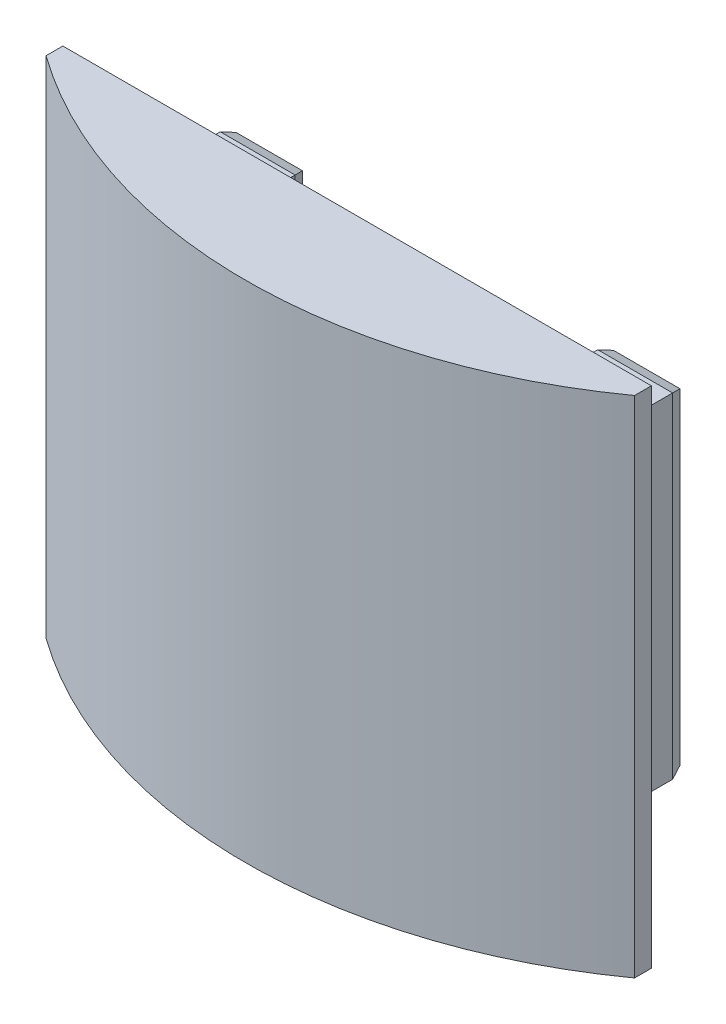
ISO-10303-21;
HEADER;
FILE_DESCRIPTION(('STEP AP214'),'2;1');
FILE_NAME('part.step','',(''),(''),'','','');
FILE_SCHEMA(('AUTOMOTIVE_DESIGN { 1 0 10303 214 1 1 1 1 }'));
ENDSEC;
DATA;
#1=APPLICATION_CONTEXT('core data for automotive mechanical design processes');
#2=APPLICATION_PROTOCOL_DEFINITION('international standard','automotive_design',2000,#1);
#3=PRODUCT_CONTEXT('',#1,'mechanical');
#4=PRODUCT('Part','Part','',(#3));
#5=PRODUCT_RELATED_PRODUCT_CATEGORY('part','',(#4));
#6=PRODUCT_DEFINITION_FORMATION('','',#4);
#7=PRODUCT_DEFINITION_CONTEXT('part definition',#1,'design');
#8=PRODUCT_DEFINITION('design','',#6,#7);
#9=PRODUCT_DEFINITION_SHAPE('','',#8);
#10=(LENGTH_UNIT() NAMED_UNIT(*) SI_UNIT(.MILLI.,.METRE.));
#11=(NAMED_UNIT(*) PLANE_ANGLE_UNIT() SI_UNIT($,.RADIAN.));
#12=(NAMED_UNIT(*) SI_UNIT($,.STERADIAN.) SOLID_ANGLE_UNIT());
#13=UNCERTAINTY_MEASURE_WITH_UNIT(LENGTH_MEASURE(1.E-05),#10,'distance_accuracy_value','');
#14=(GEOMETRIC_REPRESENTATION_CONTEXT(3) GLOBAL_UNCERTAINTY_ASSIGNED_CONTEXT((#13)) GLOBAL_UNIT_ASSIGNED_CONTEXT((#10,
#11,#12)) REPRESENTATION_CONTEXT('',''));
#15=CARTESIAN_POINT('',(0.,0.,0.));
#16=DIRECTION('',(0.,0.,1.));
#17=DIRECTION('',(1.,0.,0.));
#18=AXIS2_PLACEMENT_3D('',#15,#16,#17);
#19=CARTESIAN_POINT('',(35.,-30.,43.5));
#20=DIRECTION('',(0.,1.,0.));
#21=DIRECTION('',(0.,0.,1.));
#22=AXIS2_PLACEMENT_3D('',#19,#20,#21);
#23=PLANE('',#22);
#24=DIRECTION('',(0.,0.,-1.));
#25=VECTOR('',#24,1.);
#26=CARTESIAN_POINT('',(35.,-30.,43.5));
#27=LINE('',#26,#25);
#28=CARTESIAN_POINT('',(35.,-30.,14.));
#29=VERTEX_POINT('',#28);
#30=CARTESIAN_POINT('',(35.,-30.,12.));
#31=VERTEX_POINT('',#30);
#32=EDGE_CURVE('E171',#29,#31,#27,.T.);
#33=ORIENTED_EDGE('',*,*,#32,.F.);
#34=CARTESIAN_POINT('',(0.,-30.,-34.7339717240448));
#35=DIRECTION('',(0.,1.,0.));
#36=DIRECTION('',(0.,0.,1.));
#37=AXIS2_PLACEMENT_3D('',#34,#35,#36);
#38=CIRCLE('',#37,60.);
#39=CARTESIAN_POINT('',(-35.,-30.,14.));
#40=VERTEX_POINT('',#39);
#41=EDGE_CURVE('E155',#40,#29,#38,.T.);
#42=ORIENTED_EDGE('',*,*,#41,.F.);
#43=DIRECTION('',(0.,0.,-1.));
#44=VECTOR('',#43,1.);
#45=CARTESIAN_POINT('',(-35.,-30.,43.5));
#46=LINE('',#45,#44);
#47=CARTESIAN_POINT('',(-35.,-30.,12.));
#48=VERTEX_POINT('',#47);
#49=EDGE_CURVE('E163',#40,#48,#46,.T.);
#50=ORIENTED_EDGE('',*,*,#49,.T.);
#51=DIRECTION('',(1.,0.,0.));
#52=VECTOR('',#51,1.);
#53=CARTESIAN_POINT('',(35.,-30.,12.));
#54=LINE('',#53,#52);
#55=EDGE_CURVE('E316',#48,#31,#54,.T.);
#56=ORIENTED_EDGE('',*,*,#55,.T.);
#57=EDGE_LOOP('',(#33,#42,#50,#56));
#58=FACE_BOUND('',#57,.T.);
#59=ADVANCED_FACE('F35',(#58),#23,.F.);
#60=CARTESIAN_POINT('',(35.,30.,43.5));
#61=DIRECTION('',(0.,-1.,0.));
#62=DIRECTION('',(0.,0.,-1.));
#63=AXIS2_PLACEMENT_3D('',#60,#61,#62);
#64=PLANE('',#63);
#65=DIRECTION('',(0.,0.,-1.));
#66=VECTOR('',#65,1.);
#67=CARTESIAN_POINT('',(-35.,30.,43.5));
#68=LINE('',#67,#66);
#69=CARTESIAN_POINT('',(-35.,30.,14.));
#70=VERTEX_POINT('',#69);
#71=CARTESIAN_POINT('',(-35.,30.,12.));
#72=VERTEX_POINT('',#71);
#73=EDGE_CURVE('E161',#70,#72,#68,.T.);
#74=ORIENTED_EDGE('',*,*,#73,.F.);
#75=CARTESIAN_POINT('',(0.,30.,-34.7339717240448));
#76=DIRECTION('',(0.,1.,0.));
#77=DIRECTION('',(0.,0.,1.));
#78=AXIS2_PLACEMENT_3D('',#75,#76,#77);
#79=CIRCLE('',#78,60.);
#80=CARTESIAN_POINT('',(35.,30.,14.));
#81=VERTEX_POINT('',#80);
#82=EDGE_CURVE('E147',#70,#81,#79,.T.);
#83=ORIENTED_EDGE('',*,*,#82,.T.);
#84=DIRECTION('',(0.,0.,-1.));
#85=VECTOR('',#84,1.);
#86=CARTESIAN_POINT('',(35.,30.,43.5));
#87=LINE('',#86,#85);
#88=CARTESIAN_POINT('',(35.,30.,12.));
#89=VERTEX_POINT('',#88);
#90=EDGE_CURVE('E169',#81,#89,#87,.T.);
#91=ORIENTED_EDGE('',*,*,#90,.T.);
#92=DIRECTION('',(-1.,0.,0.));
#93=VECTOR('',#92,1.);
#94=CARTESIAN_POINT('',(35.,30.,12.));
#95=LINE('',#94,#93);
#96=EDGE_CURVE('E167',#89,#72,#95,.T.);
#97=ORIENTED_EDGE('',*,*,#96,.T.);
#98=EDGE_LOOP('',(#74,#83,#91,#97));
#99=FACE_BOUND('',#98,.T.);
#100=ADVANCED_FACE('F165',(#99),#64,.F.);
#101=CARTESIAN_POINT('',(26.9,-19.9,12.));
#102=DIRECTION('',(0.,1.,0.));
#103=DIRECTION('',(-1.,0.,0.));
#104=AXIS2_PLACEMENT_3D('',#101,#102,#103);
#105=PLANE('',#104);
#106=CARTESIAN_POINT('',(-22.5,-19.9,4.60000000000001));
#107=DIRECTION('',(0.,1.,0.));
#108=DIRECTION('',(-1.,0.,0.));
#109=AXIS2_PLACEMENT_3D('',#106,#107,#108);
#110=CIRCLE('',#109,2.1);
#111=CARTESIAN_POINT('',(-24.6,-19.9,4.60000000000001));
#112=VERTEX_POINT('',#111);
#113=EDGE_CURVE('E305',#112,#112,#110,.T.);
#114=ORIENTED_EDGE('',*,*,#113,.T.);
#115=EDGE_LOOP('',(#114));
#116=FACE_BOUND('',#115,.T.);
#117=DIRECTION('',(0.,0.,-1.));
#118=VECTOR('',#117,1.);
#119=CARTESIAN_POINT('',(-26.9,-19.9,12.));
#120=LINE('',#119,#118);
#121=CARTESIAN_POINT('',(-26.9,-19.9,12.));
#122=VERTEX_POINT('',#121);
#123=CARTESIAN_POINT('',(-26.9,-19.9,1.3737387097273));
#124=VERTEX_POINT('',#123);
#125=EDGE_CURVE('E202',#122,#124,#120,.T.);
#126=ORIENTED_EDGE('',*,*,#125,.T.);
#127=DIRECTION('',(1.,0.,0.));
#128=VECTOR('',#127,1.);
#129=CARTESIAN_POINT('',(26.9,-19.9,1.3737387097273));
#130=LINE('',#129,#128);
#131=CARTESIAN_POINT('',(-18.,-19.9,1.3737387097273));
#132=VERTEX_POINT('',#131);
#133=EDGE_CURVE('E235',#124,#132,#130,.T.);
#134=ORIENTED_EDGE('',*,*,#133,.T.);
#135=DIRECTION('',(0.,0.,-1.));
#136=VECTOR('',#135,1.);
#137=CARTESIAN_POINT('',(-18.,-19.9,65.6660041366972));
#138=LINE('',#137,#136);
#139=CARTESIAN_POINT('',(-18.,-19.9,12.));
#140=VERTEX_POINT('',#139);
#141=EDGE_CURVE('E248',#140,#132,#138,.T.);
#142=ORIENTED_EDGE('',*,*,#141,.F.);
#143=DIRECTION('',(1.,0.,0.));
#144=VECTOR('',#143,1.);
#145=CARTESIAN_POINT('',(26.9,-19.9,12.));
#146=LINE('',#145,#144);
#147=EDGE_CURVE('E183',#122,#140,#146,.T.);
#148=ORIENTED_EDGE('',*,*,#147,.F.);
#149=EDGE_LOOP('',(#126,#134,#142,#148));
#150=FACE_BOUND('',#149,.T.);
#151=ADVANCED_FACE('F282',(#116,#150),#105,.F.);
#152=CARTESIAN_POINT('',(26.9,19.9,12.));
#153=DIRECTION('',(0.,-1.,0.));
#154=DIRECTION('',(1.,0.,0.));
#155=AXIS2_PLACEMENT_3D('',#152,#153,#154);
#156=PLANE('',#155);
#157=CARTESIAN_POINT('',(-22.5,19.9,4.60000000000001));
#158=DIRECTION('',(0.,1.,0.));
#159=DIRECTION('',(-1.,0.,0.));
#160=AXIS2_PLACEMENT_3D('',#157,#158,#159);
#161=CIRCLE('',#160,2.1);
#162=CARTESIAN_POINT('',(-24.6,19.9,4.60000000000001));
#163=VERTEX_POINT('',#162);
#164=EDGE_CURVE('E302',#163,#163,#161,.T.);
#165=ORIENTED_EDGE('',*,*,#164,.F.);
#166=EDGE_LOOP('',(#165));
#167=FACE_BOUND('',#166,.T.);
#168=DIRECTION('',(0.,0.,-1.));
#169=VECTOR('',#168,1.);
#170=CARTESIAN_POINT('',(-18.,19.9,65.6660041366972));
#171=LINE('',#170,#169);
#172=CARTESIAN_POINT('',(-18.,19.9,12.));
#173=VERTEX_POINT('',#172);
#174=CARTESIAN_POINT('',(-18.,19.9,1.3737387097273));
#175=VERTEX_POINT('',#174);
#176=EDGE_CURVE('E290',#173,#175,#171,.T.);
#177=ORIENTED_EDGE('',*,*,#176,.T.);
#178=DIRECTION('',(-1.,0.,0.));
#179=VECTOR('',#178,1.);
#180=CARTESIAN_POINT('',(26.9,19.9,1.3737387097273));
#181=LINE('',#180,#179);
#182=CARTESIAN_POINT('',(-26.9,19.9,1.3737387097273));
#183=VERTEX_POINT('',#182);
#184=EDGE_CURVE('E11',#175,#183,#181,.T.);
#185=ORIENTED_EDGE('',*,*,#184,.T.);
#186=DIRECTION('',(0.,0.,-1.));
#187=VECTOR('',#186,1.);
#188=CARTESIAN_POINT('',(-26.9,19.9,12.));
#189=LINE('',#188,#187);
#190=CARTESIAN_POINT('',(-26.9,19.9,12.));
#191=VERTEX_POINT('',#190);
#192=EDGE_CURVE('E193',#191,#183,#189,.T.);
#193=ORIENTED_EDGE('',*,*,#192,.F.);
#194=DIRECTION('',(-1.,0.,0.));
#195=VECTOR('',#194,1.);
#196=CARTESIAN_POINT('',(26.9,19.9,12.));
#197=LINE('',#196,#195);
#198=EDGE_CURVE('E189',#173,#191,#197,.T.);
#199=ORIENTED_EDGE('',*,*,#198,.F.);
#200=EDGE_LOOP('',(#177,#185,#193,#199));
#201=FACE_BOUND('',#200,.T.);
#202=ADVANCED_FACE('F289',(#167,#201),#156,.F.);
#203=CARTESIAN_POINT('',(0.,0.,0.));
#204=DIRECTION('',(0.,0.,1.));
#205=DIRECTION('',(1.,0.,0.));
#206=AXIS2_PLACEMENT_3D('',#203,#204,#205);
#207=PLANE('',#206);
#208=DIRECTION('',(-1.,0.,0.));
#209=VECTOR('',#208,1.);
#210=CARTESIAN_POINT('',(0.,-19.4,0.));
#211=LINE('',#210,#209);
#212=CARTESIAN_POINT('',(-18.5,-19.4,0.));
#213=VERTEX_POINT('',#212);
#214=CARTESIAN_POINT('',(-26.4,-19.4,0.));
#215=VERTEX_POINT('',#214);
#216=EDGE_CURVE('E230',#213,#215,#211,.T.);
#217=ORIENTED_EDGE('',*,*,#216,.T.);
#218=DIRECTION('',(0.,1.,0.));
#219=VECTOR('',#218,1.);
#220=CARTESIAN_POINT('',(-26.4,0.,0.));
#221=LINE('',#220,#219);
#222=CARTESIAN_POINT('',(-26.4,19.4,0.));
#223=VERTEX_POINT('',#222);
#224=EDGE_CURVE('E232',#215,#223,#221,.T.);
#225=ORIENTED_EDGE('',*,*,#224,.T.);
#226=DIRECTION('',(1.,0.,0.));
#227=VECTOR('',#226,1.);
#228=CARTESIAN_POINT('',(0.,19.4,0.));
#229=LINE('',#228,#227);
#230=CARTESIAN_POINT('',(-18.5,19.4,0.));
#231=VERTEX_POINT('',#230);
#232=EDGE_CURVE('E226',#223,#231,#229,.T.);
#233=ORIENTED_EDGE('',*,*,#232,.T.);
#234=DIRECTION('',(0.,-1.,0.));
#235=VECTOR('',#234,1.);
#236=CARTESIAN_POINT('',(-18.5,0.,0.));
#237=LINE('',#236,#235);
#238=EDGE_CURVE('E228',#231,#213,#237,.T.);
#239=ORIENTED_EDGE('',*,*,#238,.T.);
#240=EDGE_LOOP('',(#217,#225,#233,#239));
#241=FACE_BOUND('',#240,.T.);
#242=ADVANCED_FACE('F268',(#241),#207,.F.);
#243=CARTESIAN_POINT('',(-26.9,-19.9,12.));
#244=DIRECTION('',(1.,0.,0.));
#245=DIRECTION('',(0.,0.,-1.));
#246=AXIS2_PLACEMENT_3D('',#243,#244,#245);
#247=PLANE('',#246);
#248=ORIENTED_EDGE('',*,*,#192,.T.);
#249=DIRECTION('',(0.,-1.,0.));
#250=VECTOR('',#249,1.);
#251=CARTESIAN_POINT('',(-26.9,-19.9,1.3737387097273));
#252=LINE('',#251,#250);
#253=EDGE_CURVE('E223',#183,#124,#252,.T.);
#254=ORIENTED_EDGE('',*,*,#253,.T.);
#255=ORIENTED_EDGE('',*,*,#125,.F.);
#256=DIRECTION('',(0.,-1.,0.));
#257=VECTOR('',#256,1.);
#258=CARTESIAN_POINT('',(-26.9,-19.9,12.));
#259=LINE('',#258,#257);
#260=EDGE_CURVE('E179',#191,#122,#259,.T.);
#261=ORIENTED_EDGE('',*,*,#260,.F.);
#262=EDGE_LOOP('',(#248,#254,#255,#261));
#263=FACE_BOUND('',#262,.T.);
#264=ADVANCED_FACE('F279',(#263),#247,.F.);
#265=CARTESIAN_POINT('',(22.5,-19.9,4.6));
#266=DIRECTION('',(0.,1.,0.));
#267=DIRECTION('',(-1.,0.,0.));
#268=AXIS2_PLACEMENT_3D('',#265,#266,#267);
#269=CIRCLE('',#268,2.1);
#270=CARTESIAN_POINT('',(20.4,-19.9,4.6));
#271=VERTEX_POINT('',#270);
#272=EDGE_CURVE('E311',#271,#271,#269,.T.);
#273=ORIENTED_EDGE('',*,*,#272,.T.);
#274=EDGE_LOOP('',(#273));
#275=FACE_BOUND('',#274,.T.);
#276=DIRECTION('',(0.,0.,-1.));
#277=VECTOR('',#276,1.);
#278=CARTESIAN_POINT('',(18.,-19.9,65.6660041366972));
#279=LINE('',#278,#277);
#280=CARTESIAN_POINT('',(18.,-19.9,12.));
#281=VERTEX_POINT('',#280);
#282=CARTESIAN_POINT('',(18.,-19.9,1.3737387097273));
#283=VERTEX_POINT('',#282);
#284=EDGE_CURVE('E299',#281,#283,#279,.T.);
#285=ORIENTED_EDGE('',*,*,#284,.T.);
#286=DIRECTION('',(1.,0.,0.));
#287=VECTOR('',#286,1.);
#288=CARTESIAN_POINT('',(26.9,-19.9,1.3737387097273));
#289=LINE('',#288,#287);
#290=CARTESIAN_POINT('',(26.9,-19.9,1.3737387097273));
#291=VERTEX_POINT('',#290);
#292=EDGE_CURVE('E221',#283,#291,#289,.T.);
#293=ORIENTED_EDGE('',*,*,#292,.T.);
#294=DIRECTION('',(0.,0.,-1.));
#295=VECTOR('',#294,1.);
#296=CARTESIAN_POINT('',(26.9,-19.9,12.));
#297=LINE('',#296,#295);
#298=CARTESIAN_POINT('',(26.9,-19.9,12.));
#299=VERTEX_POINT('',#298);
#300=EDGE_CURVE('E199',#299,#291,#297,.T.);
#301=ORIENTED_EDGE('',*,*,#300,.F.);
#302=EDGE_CURVE('E182',#281,#299,#146,.T.);
#303=ORIENTED_EDGE('',*,*,#302,.F.);
#304=EDGE_LOOP('',(#285,#293,#301,#303));
#305=FACE_BOUND('',#304,.T.);
#306=ADVANCED_FACE('F339',(#275,#305),#105,.F.);
#307=CARTESIAN_POINT('',(26.9,-19.9,12.));
#308=DIRECTION('',(-1.,0.,0.));
#309=DIRECTION('',(0.,0.,1.));
#310=AXIS2_PLACEMENT_3D('',#307,#308,#309);
#311=PLANE('',#310);
#312=ORIENTED_EDGE('',*,*,#300,.T.);
#313=DIRECTION('',(0.,1.,0.));
#314=VECTOR('',#313,1.);
#315=CARTESIAN_POINT('',(26.9,-19.9,1.3737387097273));
#316=LINE('',#315,#314);
#317=CARTESIAN_POINT('',(26.9,19.9,1.3737387097273));
#318=VERTEX_POINT('',#317);
#319=EDGE_CURVE('E205',#291,#318,#316,.T.);
#320=ORIENTED_EDGE('',*,*,#319,.T.);
#321=DIRECTION('',(0.,0.,-1.));
#322=VECTOR('',#321,1.);
#323=CARTESIAN_POINT('',(26.9,19.9,12.));
#324=LINE('',#323,#322);
#325=CARTESIAN_POINT('',(26.9,19.9,12.));
#326=VERTEX_POINT('',#325);
#327=EDGE_CURVE('E196',#326,#318,#324,.T.);
#328=ORIENTED_EDGE('',*,*,#327,.F.);
#329=DIRECTION('',(0.,1.,0.));
#330=VECTOR('',#329,1.);
#331=CARTESIAN_POINT('',(26.9,-19.9,12.));
#332=LINE('',#331,#330);
#333=EDGE_CURVE('E186',#299,#326,#332,.T.);
#334=ORIENTED_EDGE('',*,*,#333,.F.);
#335=EDGE_LOOP('',(#312,#320,#328,#334));
#336=FACE_BOUND('',#335,.T.);
#337=ADVANCED_FACE('F344',(#336),#311,.F.);
#338=CARTESIAN_POINT('',(22.5,19.9,4.6));
#339=DIRECTION('',(0.,1.,0.));
#340=DIRECTION('',(-1.,0.,0.));
#341=AXIS2_PLACEMENT_3D('',#338,#339,#340);
#342=CIRCLE('',#341,2.1);
#343=CARTESIAN_POINT('',(20.4,19.9,4.6));
#344=VERTEX_POINT('',#343);
#345=EDGE_CURVE('E308',#344,#344,#342,.T.);
#346=ORIENTED_EDGE('',*,*,#345,.F.);
#347=EDGE_LOOP('',(#346));
#348=FACE_BOUND('',#347,.T.);
#349=ORIENTED_EDGE('',*,*,#327,.T.);
#350=DIRECTION('',(-1.,0.,0.));
#351=VECTOR('',#350,1.);
#352=CARTESIAN_POINT('',(26.9,19.9,1.3737387097273));
#353=LINE('',#352,#351);
#354=CARTESIAN_POINT('',(18.,19.9,1.3737387097273));
#355=VERTEX_POINT('',#354);
#356=EDGE_CURVE('E217',#318,#355,#353,.T.);
#357=ORIENTED_EDGE('',*,*,#356,.T.);
#358=DIRECTION('',(0.,0.,-1.));
#359=VECTOR('',#358,1.);
#360=CARTESIAN_POINT('',(18.,19.9,65.6660041366972));
#361=LINE('',#360,#359);
#362=CARTESIAN_POINT('',(18.,19.9,12.));
#363=VERTEX_POINT('',#362);
#364=EDGE_CURVE('E291',#363,#355,#361,.T.);
#365=ORIENTED_EDGE('',*,*,#364,.F.);
#366=EDGE_CURVE('E190',#326,#363,#197,.T.);
#367=ORIENTED_EDGE('',*,*,#366,.F.);
#368=EDGE_LOOP('',(#349,#357,#365,#367));
#369=FACE_BOUND('',#368,.T.);
#370=ADVANCED_FACE('F347',(#348,#369),#156,.F.);
#371=DIRECTION('',(1.,0.,0.));
#372=VECTOR('',#371,1.);
#373=CARTESIAN_POINT('',(0.,19.4,0.));
#374=LINE('',#373,#372);
#375=CARTESIAN_POINT('',(18.5,19.4,0.));
#376=VERTEX_POINT('',#375);
#377=CARTESIAN_POINT('',(26.4,19.4,0.));
#378=VERTEX_POINT('',#377);
#379=EDGE_CURVE('E212',#376,#378,#374,.T.);
#380=ORIENTED_EDGE('',*,*,#379,.T.);
#381=DIRECTION('',(0.,-1.,0.));
#382=VECTOR('',#381,1.);
#383=CARTESIAN_POINT('',(26.4,0.,0.));
#384=LINE('',#383,#382);
#385=CARTESIAN_POINT('',(26.4,-19.4,0.));
#386=VERTEX_POINT('',#385);
#387=EDGE_CURVE('E214',#378,#386,#384,.T.);
#388=ORIENTED_EDGE('',*,*,#387,.T.);
#389=DIRECTION('',(-1.,0.,0.));
#390=VECTOR('',#389,1.);
#391=CARTESIAN_POINT('',(0.,-19.4,0.));
#392=LINE('',#391,#390);
#393=CARTESIAN_POINT('',(18.5,-19.4,0.));
#394=VERTEX_POINT('',#393);
#395=EDGE_CURVE('E208',#386,#394,#392,.T.);
#396=ORIENTED_EDGE('',*,*,#395,.T.);
#397=DIRECTION('',(0.,1.,0.));
#398=VECTOR('',#397,1.);
#399=CARTESIAN_POINT('',(18.5,0.,0.));
#400=LINE('',#399,#398);
#401=EDGE_CURVE('E210',#394,#376,#400,.T.);
#402=ORIENTED_EDGE('',*,*,#401,.T.);
#403=EDGE_LOOP('',(#380,#388,#396,#402));
#404=FACE_BOUND('',#403,.T.);
#405=ADVANCED_FACE('F359',(#404),#207,.F.);
#406=CARTESIAN_POINT('',(0.,0.,12.));
#407=DIRECTION('',(0.,0.,1.));
#408=DIRECTION('',(1.,0.,0.));
#409=AXIS2_PLACEMENT_3D('',#406,#407,#408);
#410=PLANE('',#409);
#411=ORIENTED_EDGE('',*,*,#147,.T.);
#412=DIRECTION('',(0.,1.,0.));
#413=VECTOR('',#412,1.);
#414=CARTESIAN_POINT('',(-18.,-19.9,12.));
#415=LINE('',#414,#413);
#416=EDGE_CURVE('E286',#140,#173,#415,.T.);
#417=ORIENTED_EDGE('',*,*,#416,.T.);
#418=ORIENTED_EDGE('',*,*,#198,.T.);
#419=ORIENTED_EDGE('',*,*,#260,.T.);
#420=EDGE_LOOP('',(#411,#417,#418,#419));
#421=FACE_BOUND('',#420,.T.);
#422=DIRECTION('',(0.,-1.,0.));
#423=VECTOR('',#422,1.);
#424=CARTESIAN_POINT('',(-35.,-30.,12.));
#425=LINE('',#424,#423);
#426=EDGE_CURVE('E314',#72,#48,#425,.T.);
#427=ORIENTED_EDGE('',*,*,#426,.F.);
#428=ORIENTED_EDGE('',*,*,#96,.F.);
#429=DIRECTION('',(0.,1.,0.));
#430=VECTOR('',#429,1.);
#431=CARTESIAN_POINT('',(35.,-30.,12.));
#432=LINE('',#431,#430);
#433=EDGE_CURVE('E173',#31,#89,#432,.T.);
#434=ORIENTED_EDGE('',*,*,#433,.F.);
#435=ORIENTED_EDGE('',*,*,#55,.F.);
#436=EDGE_LOOP('',(#427,#428,#434,#435));
#437=FACE_BOUND('',#436,.T.);
#438=ORIENTED_EDGE('',*,*,#366,.T.);
#439=DIRECTION('',(0.,-1.,0.));
#440=VECTOR('',#439,1.);
#441=CARTESIAN_POINT('',(18.,-19.9,12.));
#442=LINE('',#441,#440);
#443=EDGE_CURVE('E294',#363,#281,#442,.T.);
#444=ORIENTED_EDGE('',*,*,#443,.T.);
#445=ORIENTED_EDGE('',*,*,#302,.T.);
#446=ORIENTED_EDGE('',*,*,#333,.T.);
#447=EDGE_LOOP('',(#438,#444,#445,#446));
#448=FACE_BOUND('',#447,.T.);
#449=ADVANCED_FACE('F284',(#421,#437,#448),#410,.F.);
#450=CARTESIAN_POINT('',(-35.,-30.,43.5));
#451=DIRECTION('',(1.,0.,0.));
#452=DIRECTION('',(0.,1.,0.));
#453=AXIS2_PLACEMENT_3D('',#450,#451,#452);
#454=PLANE('',#453);
#455=ORIENTED_EDGE('',*,*,#49,.F.);
#456=DIRECTION('',(0.,-1.,0.));
#457=VECTOR('',#456,1.);
#458=CARTESIAN_POINT('',(-35.,30.,14.));
#459=LINE('',#458,#457);
#460=EDGE_CURVE('E150',#70,#40,#459,.T.);
#461=ORIENTED_EDGE('',*,*,#460,.F.);
#462=ORIENTED_EDGE('',*,*,#73,.T.);
#463=ORIENTED_EDGE('',*,*,#426,.T.);
#464=EDGE_LOOP('',(#455,#461,#462,#463));
#465=FACE_BOUND('',#464,.T.);
#466=ADVANCED_FACE('F159',(#465),#454,.F.);
#467=CARTESIAN_POINT('',(35.,-30.,43.5));
#468=DIRECTION('',(-1.,0.,0.));
#469=DIRECTION('',(0.,0.,1.));
#470=AXIS2_PLACEMENT_3D('',#467,#468,#469);
#471=PLANE('',#470);
#472=ORIENTED_EDGE('',*,*,#90,.F.);
#473=DIRECTION('',(0.,-1.,0.));
#474=VECTOR('',#473,1.);
#475=CARTESIAN_POINT('',(35.,30.,14.));
#476=LINE('',#475,#474);
#477=EDGE_CURVE('E52',#81,#29,#476,.T.);
#478=ORIENTED_EDGE('',*,*,#477,.T.);
#479=ORIENTED_EDGE('',*,*,#32,.T.);
#480=ORIENTED_EDGE('',*,*,#433,.T.);
#481=EDGE_LOOP('',(#472,#478,#479,#480));
#482=FACE_BOUND('',#481,.T.);
#483=ADVANCED_FACE('F321',(#482),#471,.F.);
#484=CARTESIAN_POINT('',(22.5,-30.,4.6));
#485=DIRECTION('',(0.,1.,0.));
#486=DIRECTION('',(-1.,0.,0.));
#487=AXIS2_PLACEMENT_3D('',#484,#485,#486);
#488=CYLINDRICAL_SURFACE('',#487,2.1);
#489=ORIENTED_EDGE('',*,*,#345,.T.);
#490=EDGE_LOOP('',(#489));
#491=FACE_BOUND('',#490,.T.);
#492=ORIENTED_EDGE('',*,*,#272,.F.);
#493=EDGE_LOOP('',(#492));
#494=FACE_BOUND('',#493,.T.);
#495=ADVANCED_FACE('F423',(#491,#494),#488,.F.);
#496=CARTESIAN_POINT('',(-22.5,-30.,4.60000000000001));
#497=DIRECTION('',(0.,1.,0.));
#498=DIRECTION('',(-1.,0.,0.));
#499=AXIS2_PLACEMENT_3D('',#496,#497,#498);
#500=CYLINDRICAL_SURFACE('',#499,2.1);
#501=ORIENTED_EDGE('',*,*,#164,.T.);
#502=EDGE_LOOP('',(#501));
#503=FACE_BOUND('',#502,.T.);
#504=ORIENTED_EDGE('',*,*,#113,.F.);
#505=EDGE_LOOP('',(#504));
#506=FACE_BOUND('',#505,.T.);
#507=ADVANCED_FACE('F420',(#503,#506),#500,.F.);
#508=CARTESIAN_POINT('',(-18.,-19.9,65.6660041366972));
#509=DIRECTION('',(-1.,0.,0.));
#510=DIRECTION('',(0.,0.,1.));
#511=AXIS2_PLACEMENT_3D('',#508,#509,#510);
#512=PLANE('',#511);
#513=ORIENTED_EDGE('',*,*,#141,.T.);
#514=DIRECTION('',(0.,1.,0.));
#515=VECTOR('',#514,1.);
#516=CARTESIAN_POINT('',(-18.,-19.9,1.3737387097273));
#517=LINE('',#516,#515);
#518=EDGE_CURVE('E44',#132,#175,#517,.T.);
#519=ORIENTED_EDGE('',*,*,#518,.T.);
#520=ORIENTED_EDGE('',*,*,#176,.F.);
#521=ORIENTED_EDGE('',*,*,#416,.F.);
#522=EDGE_LOOP('',(#513,#519,#520,#521));
#523=FACE_BOUND('',#522,.T.);
#524=ADVANCED_FACE('F417',(#523),#512,.F.);
#525=CARTESIAN_POINT('',(18.,-19.9,65.6660041366972));
#526=DIRECTION('',(1.,0.,0.));
#527=DIRECTION('',(0.,0.,-1.));
#528=AXIS2_PLACEMENT_3D('',#525,#526,#527);
#529=PLANE('',#528);
#530=ORIENTED_EDGE('',*,*,#364,.T.);
#531=DIRECTION('',(0.,-1.,0.));
#532=VECTOR('',#531,1.);
#533=CARTESIAN_POINT('',(18.,-19.9,1.3737387097273));
#534=LINE('',#533,#532);
#535=EDGE_CURVE('E219',#355,#283,#534,.T.);
#536=ORIENTED_EDGE('',*,*,#535,.T.);
#537=ORIENTED_EDGE('',*,*,#284,.F.);
#538=ORIENTED_EDGE('',*,*,#443,.F.);
#539=EDGE_LOOP('',(#530,#536,#537,#538));
#540=FACE_BOUND('',#539,.T.);
#541=ADVANCED_FACE('F335',(#540),#529,.F.);
#542=CARTESIAN_POINT('',(18.,-19.9,1.3737387097273));
#543=DIRECTION('',(0.939692620785908,0.,0.342020143325671));
#544=DIRECTION('',(0.,-1.,0.));
#545=AXIS2_PLACEMENT_3D('',#542,#543,#544);
#546=PLANE('',#545);
#547=DIRECTION('',(0.323615577118186,-0.323615577118186,-0.889126490715987));
#548=VECTOR('',#547,1.);
#549=CARTESIAN_POINT('',(22.1681362617908,15.7318637382092,-10.0781215507527));
#550=LINE('',#549,#548);
#551=EDGE_CURVE('E242',#376,#355,#550,.F.);
#552=ORIENTED_EDGE('',*,*,#551,.F.);
#553=ORIENTED_EDGE('',*,*,#401,.F.);
#554=DIRECTION('',(0.323615577118186,0.323615577118186,-0.889126490715987));
#555=VECTOR('',#554,1.);
#556=CARTESIAN_POINT('',(18.9320706716065,-18.9679293283935,-1.18710441384738));
#557=LINE('',#556,#555);
#558=EDGE_CURVE('E245',#283,#394,#557,.T.);
#559=ORIENTED_EDGE('',*,*,#558,.F.);
#560=ORIENTED_EDGE('',*,*,#535,.F.);
#561=EDGE_LOOP('',(#552,#553,#559,#560));
#562=FACE_BOUND('',#561,.T.);
#563=ADVANCED_FACE('F351',(#562),#546,.F.);
#564=CARTESIAN_POINT('',(26.9,-19.9,1.3737387097273));
#565=DIRECTION('',(0.,0.939692620785908,0.342020143325671));
#566=DIRECTION('',(1.,0.,0.));
#567=AXIS2_PLACEMENT_3D('',#564,#565,#566);
#568=PLANE('',#567);
#569=ORIENTED_EDGE('',*,*,#558,.T.);
#570=ORIENTED_EDGE('',*,*,#395,.F.);
#571=DIRECTION('',(0.323615577118186,-0.323615577118186,0.889126490715987));
#572=VECTOR('',#571,1.);
#573=CARTESIAN_POINT('',(26.9,-19.9,1.3737387097273));
#574=LINE('',#573,#572);
#575=EDGE_CURVE('E240',#291,#386,#574,.F.);
#576=ORIENTED_EDGE('',*,*,#575,.F.);
#577=ORIENTED_EDGE('',*,*,#292,.F.);
#578=EDGE_LOOP('',(#569,#570,#576,#577));
#579=FACE_BOUND('',#578,.T.);
#580=ADVANCED_FACE('F364',(#579),#568,.F.);
#581=CARTESIAN_POINT('',(26.9,19.9,1.3737387097273));
#582=DIRECTION('',(0.,-0.939692620785908,0.342020143325671));
#583=DIRECTION('',(-1.,0.,0.));
#584=AXIS2_PLACEMENT_3D('',#581,#582,#583);
#585=PLANE('',#584);
#586=ORIENTED_EDGE('',*,*,#551,.T.);
#587=ORIENTED_EDGE('',*,*,#356,.F.);
#588=DIRECTION('',(-0.323615577118186,-0.323615577118186,-0.889126490715987));
#589=VECTOR('',#588,1.);
#590=CARTESIAN_POINT('',(26.9,19.9,1.3737387097273));
#591=LINE('',#590,#589);
#592=EDGE_CURVE('E238',#378,#318,#591,.F.);
#593=ORIENTED_EDGE('',*,*,#592,.F.);
#594=ORIENTED_EDGE('',*,*,#379,.F.);
#595=EDGE_LOOP('',(#586,#587,#593,#594));
#596=FACE_BOUND('',#595,.T.);
#597=ADVANCED_FACE('F355',(#596),#585,.F.);
#598=CARTESIAN_POINT('',(26.9,-19.9,1.3737387097273));
#599=DIRECTION('',(-0.939692620785908,0.,0.342020143325671));
#600=DIRECTION('',(0.,1.,0.));
#601=AXIS2_PLACEMENT_3D('',#598,#599,#600);
#602=PLANE('',#601);
#603=ORIENTED_EDGE('',*,*,#575,.T.);
#604=ORIENTED_EDGE('',*,*,#387,.F.);
#605=ORIENTED_EDGE('',*,*,#592,.T.);
#606=ORIENTED_EDGE('',*,*,#319,.F.);
#607=EDGE_LOOP('',(#603,#604,#605,#606));
#608=FACE_BOUND('',#607,.T.);
#609=ADVANCED_FACE('F361',(#608),#602,.F.);
#610=CARTESIAN_POINT('',(-18.,-19.9,1.3737387097273));
#611=DIRECTION('',(-0.939692620785908,0.,0.342020143325671));
#612=DIRECTION('',(0.,1.,0.));
#613=AXIS2_PLACEMENT_3D('',#610,#611,#612);
#614=PLANE('',#613);
#615=DIRECTION('',(-0.323615577118186,0.323615577118186,-0.889126490715987));
#616=VECTOR('',#615,1.);
#617=CARTESIAN_POINT('',(-18.,-19.9,1.3737387097273));
#618=LINE('',#617,#616);
#619=EDGE_CURVE('E252',#213,#132,#618,.F.);
#620=ORIENTED_EDGE('',*,*,#619,.F.);
#621=ORIENTED_EDGE('',*,*,#238,.F.);
#622=DIRECTION('',(-0.323615577118186,-0.323615577118186,-0.889126490715987));
#623=VECTOR('',#622,1.);
#624=CARTESIAN_POINT('',(-13.2977558252662,24.6022441747338,14.2930484005704));
#625=LINE('',#624,#623);
#626=EDGE_CURVE('E39',#175,#231,#625,.T.);
#627=ORIENTED_EDGE('',*,*,#626,.F.);
#628=ORIENTED_EDGE('',*,*,#518,.F.);
#629=EDGE_LOOP('',(#620,#621,#627,#628));
#630=FACE_BOUND('',#629,.T.);
#631=ADVANCED_FACE('F37',(#630),#614,.F.);
#632=CARTESIAN_POINT('',(26.9,19.9,1.3737387097273));
#633=DIRECTION('',(0.,-0.939692620785908,0.342020143325671));
#634=DIRECTION('',(-1.,0.,0.));
#635=AXIS2_PLACEMENT_3D('',#632,#633,#634);
#636=PLANE('',#635);
#637=ORIENTED_EDGE('',*,*,#626,.T.);
#638=ORIENTED_EDGE('',*,*,#232,.F.);
#639=DIRECTION('',(-0.323615577118186,0.323615577118186,0.889126490715987));
#640=VECTOR('',#639,1.);
#641=CARTESIAN_POINT('',(-21.2656851536597,14.2656851536597,-14.1064141046905));
#642=LINE('',#641,#640);
#643=EDGE_CURVE('E251',#183,#223,#642,.F.);
#644=ORIENTED_EDGE('',*,*,#643,.F.);
#645=ORIENTED_EDGE('',*,*,#184,.F.);
#646=EDGE_LOOP('',(#637,#638,#644,#645));
#647=FACE_BOUND('',#646,.T.);
#648=ADVANCED_FACE('F263',(#647),#636,.F.);
#649=CARTESIAN_POINT('',(26.9,-19.9,1.3737387097273));
#650=DIRECTION('',(0.,0.939692620785908,0.342020143325671));
#651=DIRECTION('',(1.,0.,0.));
#652=AXIS2_PLACEMENT_3D('',#649,#650,#651);
#653=PLANE('',#652);
#654=ORIENTED_EDGE('',*,*,#619,.T.);
#655=ORIENTED_EDGE('',*,*,#133,.F.);
#656=DIRECTION('',(0.323615577118186,0.323615577118186,-0.889126490715987));
#657=VECTOR('',#656,1.);
#658=CARTESIAN_POINT('',(-21.2656851536597,-14.2656851536597,-14.1064141046905));
#659=LINE('',#658,#657);
#660=EDGE_CURVE('E249',#215,#124,#659,.F.);
#661=ORIENTED_EDGE('',*,*,#660,.F.);
#662=ORIENTED_EDGE('',*,*,#216,.F.);
#663=EDGE_LOOP('',(#654,#655,#661,#662));
#664=FACE_BOUND('',#663,.T.);
#665=ADVANCED_FACE('F274',(#664),#653,.F.);
#666=CARTESIAN_POINT('',(-26.9,-19.9,1.3737387097273));
#667=DIRECTION('',(0.939692620785908,0.,0.342020143325671));
#668=DIRECTION('',(0.,-1.,0.));
#669=AXIS2_PLACEMENT_3D('',#666,#667,#668);
#670=PLANE('',#669);
#671=ORIENTED_EDGE('',*,*,#643,.T.);
#672=ORIENTED_EDGE('',*,*,#224,.F.);
#673=ORIENTED_EDGE('',*,*,#660,.T.);
#674=ORIENTED_EDGE('',*,*,#253,.F.);
#675=EDGE_LOOP('',(#671,#672,#673,#674));
#676=FACE_BOUND('',#675,.T.);
#677=ADVANCED_FACE('F272',(#676),#670,.F.);
#678=CARTESIAN_POINT('',(0.,30.,-34.7339717240448));
#679=DIRECTION('',(0.,-1.,0.));
#680=DIRECTION('',(0.,0.,-1.));
#681=AXIS2_PLACEMENT_3D('',#678,#679,#680);
#682=CYLINDRICAL_SURFACE('',#681,60.);
#683=ORIENTED_EDGE('',*,*,#41,.T.);
#684=ORIENTED_EDGE('',*,*,#477,.F.);
#685=ORIENTED_EDGE('',*,*,#82,.F.);
#686=ORIENTED_EDGE('',*,*,#460,.T.);
#687=EDGE_LOOP('',(#683,#684,#685,#686));
#688=FACE_BOUND('',#687,.T.);
#689=ADVANCED_FACE('F149',(#688),#682,.T.);
#690=CLOSED_SHELL('',(#59,#100,#151,#202,#242,#264,#306,#337,#370,#405,#449,#466,#483,#495,#507,
#524,#541,#563,#580,#597,#609,#631,#648,#665,#677,#689));
#691=MANIFOLD_SOLID_BREP('B2',#690);
#692=ADVANCED_BREP_SHAPE_REPRESENTATION('',(#18,#691),#14);
#693=SHAPE_DEFINITION_REPRESENTATION(#9,#692);
ENDSEC;
END-ISO-10303-21;
